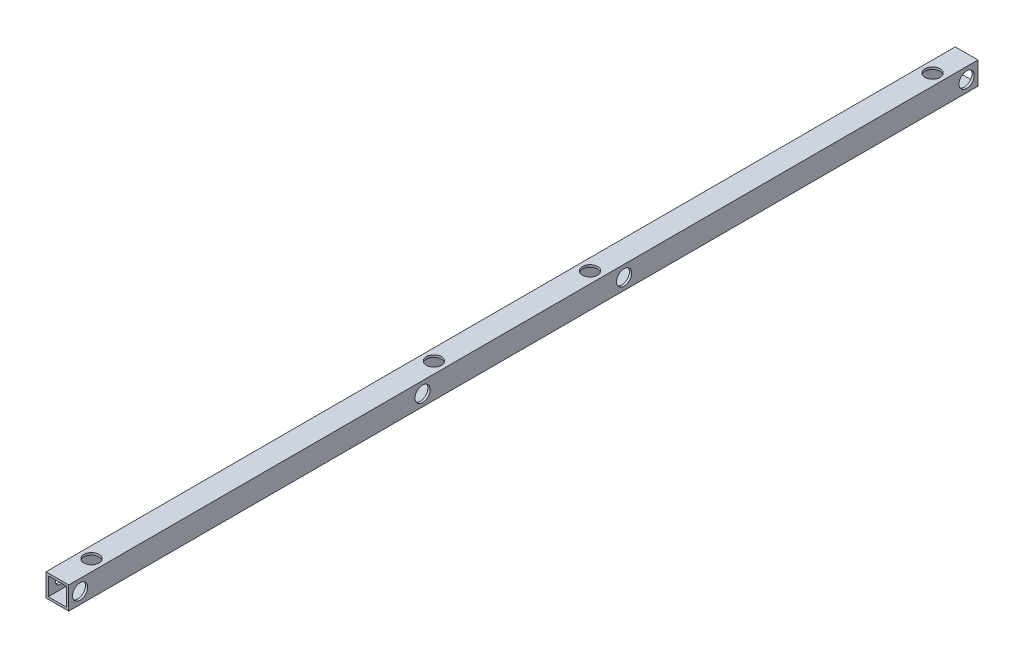
ISO-10303-21;
HEADER;
FILE_DESCRIPTION(('STEP AP214'),'2;1');
FILE_NAME('part.step','',(''),(''),'','','');
FILE_SCHEMA(('AUTOMOTIVE_DESIGN { 1 0 10303 214 1 1 1 1 }'));
ENDSEC;
DATA;
#1=APPLICATION_CONTEXT('core data for automotive mechanical design processes');
#2=APPLICATION_PROTOCOL_DEFINITION('international standard','automotive_design',2000,#1);
#3=PRODUCT_CONTEXT('',#1,'mechanical');
#4=PRODUCT('Part','Part','',(#3));
#5=PRODUCT_RELATED_PRODUCT_CATEGORY('part','',(#4));
#6=PRODUCT_DEFINITION_FORMATION('','',#4);
#7=PRODUCT_DEFINITION_CONTEXT('part definition',#1,'design');
#8=PRODUCT_DEFINITION('design','',#6,#7);
#9=PRODUCT_DEFINITION_SHAPE('','',#8);
#10=(LENGTH_UNIT() NAMED_UNIT(*) SI_UNIT(.MILLI.,.METRE.));
#11=(NAMED_UNIT(*) PLANE_ANGLE_UNIT() SI_UNIT($,.RADIAN.));
#12=(NAMED_UNIT(*) SI_UNIT($,.STERADIAN.) SOLID_ANGLE_UNIT());
#13=UNCERTAINTY_MEASURE_WITH_UNIT(LENGTH_MEASURE(1.E-05),#10,'distance_accuracy_value','');
#14=(GEOMETRIC_REPRESENTATION_CONTEXT(3) GLOBAL_UNCERTAINTY_ASSIGNED_CONTEXT((#13)) GLOBAL_UNIT_ASSIGNED_CONTEXT((#10,
#11,#12)) REPRESENTATION_CONTEXT('',''));
#15=CARTESIAN_POINT('',(0.,0.,0.));
#16=DIRECTION('',(0.,0.,1.));
#17=DIRECTION('',(1.,0.,0.));
#18=AXIS2_PLACEMENT_3D('',#15,#16,#17);
#19=CARTESIAN_POINT('',(0.,0.,600.));
#20=DIRECTION('',(0.,0.,-1.));
#21=DIRECTION('',(-1.,0.,0.));
#22=AXIS2_PLACEMENT_3D('',#19,#20,#21);
#23=PLANE('',#22);
#24=DIRECTION('',(0.,1.,0.));
#25=VECTOR('',#24,1.);
#26=CARTESIAN_POINT('',(7.5,-7.5,600.));
#27=LINE('',#26,#25);
#28=CARTESIAN_POINT('',(7.5,-7.5,600.));
#29=VERTEX_POINT('',#28);
#30=CARTESIAN_POINT('',(7.5,7.5,600.));
#31=VERTEX_POINT('',#30);
#32=EDGE_CURVE('E162',#29,#31,#27,.T.);
#33=ORIENTED_EDGE('',*,*,#32,.T.);
#34=DIRECTION('',(-1.,0.,0.));
#35=VECTOR('',#34,1.);
#36=CARTESIAN_POINT('',(-7.5,7.5,600.));
#37=LINE('',#36,#35);
#38=CARTESIAN_POINT('',(-7.5,7.5,600.));
#39=VERTEX_POINT('',#38);
#40=EDGE_CURVE('E166',#31,#39,#37,.T.);
#41=ORIENTED_EDGE('',*,*,#40,.T.);
#42=DIRECTION('',(0.,-1.,0.));
#43=VECTOR('',#42,1.);
#44=CARTESIAN_POINT('',(-7.5,-7.5,600.));
#45=LINE('',#44,#43);
#46=CARTESIAN_POINT('',(-7.5,-7.5,600.));
#47=VERTEX_POINT('',#46);
#48=EDGE_CURVE('E170',#39,#47,#45,.T.);
#49=ORIENTED_EDGE('',*,*,#48,.T.);
#50=DIRECTION('',(1.,0.,0.));
#51=VECTOR('',#50,1.);
#52=CARTESIAN_POINT('',(-7.5,-7.5,600.));
#53=LINE('',#52,#51);
#54=EDGE_CURVE('E173',#47,#29,#53,.T.);
#55=ORIENTED_EDGE('',*,*,#54,.T.);
#56=EDGE_LOOP('',(#33,#41,#49,#55));
#57=FACE_BOUND('',#56,.T.);
#58=DIRECTION('',(0.,1.,0.));
#59=VECTOR('',#58,1.);
#60=CARTESIAN_POINT('',(6.,-6.,600.));
#61=LINE('',#60,#59);
#62=CARTESIAN_POINT('',(6.,-6.,600.));
#63=VERTEX_POINT('',#62);
#64=CARTESIAN_POINT('',(6.,6.,600.));
#65=VERTEX_POINT('',#64);
#66=EDGE_CURVE('E111',#63,#65,#61,.T.);
#67=ORIENTED_EDGE('',*,*,#66,.F.);
#68=DIRECTION('',(1.,0.,0.));
#69=VECTOR('',#68,1.);
#70=CARTESIAN_POINT('',(-6.,-6.,600.));
#71=LINE('',#70,#69);
#72=CARTESIAN_POINT('',(-6.,-6.,600.));
#73=VERTEX_POINT('',#72);
#74=EDGE_CURVE('E138',#73,#63,#71,.T.);
#75=ORIENTED_EDGE('',*,*,#74,.F.);
#76=DIRECTION('',(0.,-1.,0.));
#77=VECTOR('',#76,1.);
#78=CARTESIAN_POINT('',(-6.,-6.,600.));
#79=LINE('',#78,#77);
#80=CARTESIAN_POINT('',(-6.,6.,600.));
#81=VERTEX_POINT('',#80);
#82=EDGE_CURVE('E133',#81,#73,#79,.T.);
#83=ORIENTED_EDGE('',*,*,#82,.F.);
#84=DIRECTION('',(-1.,0.,0.));
#85=VECTOR('',#84,1.);
#86=CARTESIAN_POINT('',(-6.,6.,600.));
#87=LINE('',#86,#85);
#88=EDGE_CURVE('E120',#65,#81,#87,.T.);
#89=ORIENTED_EDGE('',*,*,#88,.F.);
#90=EDGE_LOOP('',(#67,#75,#83,#89));
#91=FACE_BOUND('',#90,.T.);
#92=ADVANCED_FACE('F43',(#57,#91),#23,.F.);
#93=CARTESIAN_POINT('',(0.,0.,0.));
#94=DIRECTION('',(0.,0.,-1.));
#95=DIRECTION('',(-1.,0.,0.));
#96=AXIS2_PLACEMENT_3D('',#93,#94,#95);
#97=PLANE('',#96);
#98=DIRECTION('',(0.,1.,0.));
#99=VECTOR('',#98,1.);
#100=CARTESIAN_POINT('',(7.5,-7.5,0.));
#101=LINE('',#100,#99);
#102=CARTESIAN_POINT('',(7.5,-7.5,0.));
#103=VERTEX_POINT('',#102);
#104=CARTESIAN_POINT('',(7.5,7.5,0.));
#105=VERTEX_POINT('',#104);
#106=EDGE_CURVE('E129',#103,#105,#101,.T.);
#107=ORIENTED_EDGE('',*,*,#106,.F.);
#108=DIRECTION('',(1.,0.,0.));
#109=VECTOR('',#108,1.);
#110=CARTESIAN_POINT('',(-7.5,-7.5,0.));
#111=LINE('',#110,#109);
#112=CARTESIAN_POINT('',(-7.5,-7.5,0.));
#113=VERTEX_POINT('',#112);
#114=EDGE_CURVE('E167',#113,#103,#111,.T.);
#115=ORIENTED_EDGE('',*,*,#114,.F.);
#116=DIRECTION('',(0.,-1.,0.));
#117=VECTOR('',#116,1.);
#118=CARTESIAN_POINT('',(-7.5,-7.5,0.));
#119=LINE('',#118,#117);
#120=CARTESIAN_POINT('',(-7.5,7.5,0.));
#121=VERTEX_POINT('',#120);
#122=EDGE_CURVE('E183',#121,#113,#119,.T.);
#123=ORIENTED_EDGE('',*,*,#122,.F.);
#124=DIRECTION('',(-1.,0.,0.));
#125=VECTOR('',#124,1.);
#126=CARTESIAN_POINT('',(-7.5,7.5,0.));
#127=LINE('',#126,#125);
#128=EDGE_CURVE('E180',#105,#121,#127,.T.);
#129=ORIENTED_EDGE('',*,*,#128,.F.);
#130=EDGE_LOOP('',(#107,#115,#123,#129));
#131=FACE_BOUND('',#130,.T.);
#132=DIRECTION('',(1.,0.,0.));
#133=VECTOR('',#132,1.);
#134=CARTESIAN_POINT('',(-6.,-6.,0.));
#135=LINE('',#134,#133);
#136=CARTESIAN_POINT('',(-6.,-6.,0.));
#137=VERTEX_POINT('',#136);
#138=CARTESIAN_POINT('',(6.,-6.,0.));
#139=VERTEX_POINT('',#138);
#140=EDGE_CURVE('E121',#137,#139,#135,.T.);
#141=ORIENTED_EDGE('',*,*,#140,.T.);
#142=DIRECTION('',(0.,1.,0.));
#143=VECTOR('',#142,1.);
#144=CARTESIAN_POINT('',(6.,-6.,0.));
#145=LINE('',#144,#143);
#146=CARTESIAN_POINT('',(6.,6.,0.));
#147=VERTEX_POINT('',#146);
#148=EDGE_CURVE('E69',#139,#147,#145,.T.);
#149=ORIENTED_EDGE('',*,*,#148,.T.);
#150=DIRECTION('',(-1.,0.,0.));
#151=VECTOR('',#150,1.);
#152=CARTESIAN_POINT('',(-6.,6.,0.));
#153=LINE('',#152,#151);
#154=CARTESIAN_POINT('',(-6.,6.,0.));
#155=VERTEX_POINT('',#154);
#156=EDGE_CURVE('E127',#147,#155,#153,.T.);
#157=ORIENTED_EDGE('',*,*,#156,.T.);
#158=DIRECTION('',(0.,-1.,0.));
#159=VECTOR('',#158,1.);
#160=CARTESIAN_POINT('',(-6.,-6.,0.));
#161=LINE('',#160,#159);
#162=EDGE_CURVE('E149',#155,#137,#161,.T.);
#163=ORIENTED_EDGE('',*,*,#162,.T.);
#164=EDGE_LOOP('',(#141,#149,#157,#163));
#165=FACE_BOUND('',#164,.T.);
#166=ADVANCED_FACE('F333',(#131,#165),#97,.T.);
#167=CARTESIAN_POINT('',(7.5,-7.5,600.));
#168=DIRECTION('',(-1.,0.,0.));
#169=DIRECTION('',(0.,0.,1.));
#170=AXIS2_PLACEMENT_3D('',#167,#168,#169);
#171=PLANE('',#170);
#172=CARTESIAN_POINT('',(7.5,0.,592.5));
#173=DIRECTION('',(1.,0.,0.));
#174=DIRECTION('',(0.,0.,-1.));
#175=AXIS2_PLACEMENT_3D('',#172,#173,#174);
#176=CIRCLE('',#175,5.00000000000004);
#177=CARTESIAN_POINT('',(7.5,0.,587.5));
#178=VERTEX_POINT('',#177);
#179=EDGE_CURVE('E259',#178,#178,#176,.T.);
#180=ORIENTED_EDGE('',*,*,#179,.F.);
#181=EDGE_LOOP('',(#180));
#182=FACE_BOUND('',#181,.T.);
#183=CARTESIAN_POINT('',(7.5,0.,366.5));
#184=DIRECTION('',(1.,0.,0.));
#185=DIRECTION('',(0.,0.,-1.));
#186=AXIS2_PLACEMENT_3D('',#183,#184,#185);
#187=CIRCLE('',#186,4.99999999999999);
#188=CARTESIAN_POINT('',(7.5,0.,361.5));
#189=VERTEX_POINT('',#188);
#190=EDGE_CURVE('E529',#189,#189,#187,.T.);
#191=ORIENTED_EDGE('',*,*,#190,.F.);
#192=EDGE_LOOP('',(#191));
#193=FACE_BOUND('',#192,.T.);
#194=CARTESIAN_POINT('',(7.5,0.,233.5));
#195=DIRECTION('',(1.,0.,0.));
#196=DIRECTION('',(0.,0.,-1.));
#197=AXIS2_PLACEMENT_3D('',#194,#195,#196);
#198=CIRCLE('',#197,4.99999999999999);
#199=CARTESIAN_POINT('',(7.5,0.,228.5));
#200=VERTEX_POINT('',#199);
#201=EDGE_CURVE('E534',#200,#200,#198,.T.);
#202=ORIENTED_EDGE('',*,*,#201,.F.);
#203=EDGE_LOOP('',(#202));
#204=FACE_BOUND('',#203,.T.);
#205=CARTESIAN_POINT('',(7.5,0.,7.5));
#206=DIRECTION('',(1.,0.,0.));
#207=DIRECTION('',(0.,0.,-1.));
#208=AXIS2_PLACEMENT_3D('',#205,#206,#207);
#209=CIRCLE('',#208,5.);
#210=CARTESIAN_POINT('',(7.5,0.,2.5));
#211=VERTEX_POINT('',#210);
#212=EDGE_CURVE('E540',#211,#211,#209,.T.);
#213=ORIENTED_EDGE('',*,*,#212,.F.);
#214=EDGE_LOOP('',(#213));
#215=FACE_BOUND('',#214,.T.);
#216=ORIENTED_EDGE('',*,*,#106,.T.);
#217=DIRECTION('',(0.,0.,-1.));
#218=VECTOR('',#217,1.);
#219=CARTESIAN_POINT('',(7.5,7.5,600.));
#220=LINE('',#219,#218);
#221=EDGE_CURVE('E11',#31,#105,#220,.T.);
#222=ORIENTED_EDGE('',*,*,#221,.F.);
#223=ORIENTED_EDGE('',*,*,#32,.F.);
#224=DIRECTION('',(0.,0.,-1.));
#225=VECTOR('',#224,1.);
#226=CARTESIAN_POINT('',(7.5,-7.5,600.));
#227=LINE('',#226,#225);
#228=EDGE_CURVE('E176',#29,#103,#227,.T.);
#229=ORIENTED_EDGE('',*,*,#228,.T.);
#230=EDGE_LOOP('',(#216,#222,#223,#229));
#231=FACE_BOUND('',#230,.T.);
#232=ADVANCED_FACE('F45',(#182,#193,#204,#215,#231),#171,.F.);
#233=CARTESIAN_POINT('',(-7.5,7.5,600.));
#234=DIRECTION('',(0.,-1.,0.));
#235=DIRECTION('',(0.,0.,-1.));
#236=AXIS2_PLACEMENT_3D('',#233,#234,#235);
#237=PLANE('',#236);
#238=CARTESIAN_POINT('',(0.,7.5,577.5));
#239=DIRECTION('',(0.,1.,0.));
#240=DIRECTION('',(0.,0.,1.));
#241=AXIS2_PLACEMENT_3D('',#238,#239,#240);
#242=CIRCLE('',#241,5.);
#243=CARTESIAN_POINT('',(0.,7.5,582.5));
#244=VERTEX_POINT('',#243);
#245=EDGE_CURVE('E243',#244,#244,#242,.T.);
#246=ORIENTED_EDGE('',*,*,#245,.F.);
#247=EDGE_LOOP('',(#246));
#248=FACE_BOUND('',#247,.T.);
#249=CARTESIAN_POINT('',(1.20131184839878E-12,7.5,351.5));
#250=DIRECTION('',(0.,1.,0.));
#251=DIRECTION('',(0.,0.,1.));
#252=AXIS2_PLACEMENT_3D('',#249,#250,#251);
#253=CIRCLE('',#252,5.);
#254=CARTESIAN_POINT('',(1.20131184839878E-12,7.5,356.5));
#255=VERTEX_POINT('',#254);
#256=EDGE_CURVE('E283',#255,#255,#253,.T.);
#257=ORIENTED_EDGE('',*,*,#256,.F.);
#258=EDGE_LOOP('',(#257));
#259=FACE_BOUND('',#258,.T.);
#260=CARTESIAN_POINT('',(1.23350956270674E-12,7.5,248.5));
#261=DIRECTION('',(0.,1.,0.));
#262=DIRECTION('',(0.,0.,1.));
#263=AXIS2_PLACEMENT_3D('',#260,#261,#262);
#264=CIRCLE('',#263,5.);
#265=CARTESIAN_POINT('',(1.23350956270674E-12,7.5,253.5));
#266=VERTEX_POINT('',#265);
#267=EDGE_CURVE('E276',#266,#266,#264,.T.);
#268=ORIENTED_EDGE('',*,*,#267,.F.);
#269=EDGE_LOOP('',(#268));
#270=FACE_BOUND('',#269,.T.);
#271=CARTESIAN_POINT('',(2.67069220397528E-12,7.5,22.5));
#272=DIRECTION('',(0.,1.,0.));
#273=DIRECTION('',(0.,0.,1.));
#274=AXIS2_PLACEMENT_3D('',#271,#272,#273);
#275=CIRCLE('',#274,5.00000000000316);
#276=CARTESIAN_POINT('',(2.67069220397528E-12,7.5,27.5000000000031));
#277=VERTEX_POINT('',#276);
#278=EDGE_CURVE('E270',#277,#277,#275,.T.);
#279=ORIENTED_EDGE('',*,*,#278,.F.);
#280=EDGE_LOOP('',(#279));
#281=FACE_BOUND('',#280,.T.);
#282=ORIENTED_EDGE('',*,*,#128,.T.);
#283=DIRECTION('',(0.,0.,-1.));
#284=VECTOR('',#283,1.);
#285=CARTESIAN_POINT('',(-7.5,7.5,600.));
#286=LINE('',#285,#284);
#287=EDGE_CURVE('E53',#39,#121,#286,.T.);
#288=ORIENTED_EDGE('',*,*,#287,.F.);
#289=ORIENTED_EDGE('',*,*,#40,.F.);
#290=ORIENTED_EDGE('',*,*,#221,.T.);
#291=EDGE_LOOP('',(#282,#288,#289,#290));
#292=FACE_BOUND('',#291,.T.);
#293=ADVANCED_FACE('F348',(#248,#259,#270,#281,#292),#237,.F.);
#294=CARTESIAN_POINT('',(-7.5,-7.5,600.));
#295=DIRECTION('',(1.,0.,0.));
#296=DIRECTION('',(0.,0.,-1.));
#297=AXIS2_PLACEMENT_3D('',#294,#295,#296);
#298=PLANE('',#297);
#299=CARTESIAN_POINT('',(-7.5,0.,592.5));
#300=DIRECTION('',(1.,0.,0.));
#301=DIRECTION('',(0.,0.,-1.));
#302=AXIS2_PLACEMENT_3D('',#299,#300,#301);
#303=CIRCLE('',#302,2.70000000000001);
#304=CARTESIAN_POINT('',(-7.5,0.,589.8));
#305=VERTEX_POINT('',#304);
#306=EDGE_CURVE('E146',#305,#305,#303,.T.);
#307=ORIENTED_EDGE('',*,*,#306,.T.);
#308=EDGE_LOOP('',(#307));
#309=FACE_BOUND('',#308,.T.);
#310=CARTESIAN_POINT('',(-7.5,0.,233.5));
#311=DIRECTION('',(1.,0.,0.));
#312=DIRECTION('',(0.,0.,-1.));
#313=AXIS2_PLACEMENT_3D('',#310,#311,#312);
#314=CIRCLE('',#313,2.70000000000001);
#315=CARTESIAN_POINT('',(-7.5,0.,230.8));
#316=VERTEX_POINT('',#315);
#317=EDGE_CURVE('E213',#316,#316,#314,.T.);
#318=ORIENTED_EDGE('',*,*,#317,.T.);
#319=EDGE_LOOP('',(#318));
#320=FACE_BOUND('',#319,.T.);
#321=CARTESIAN_POINT('',(-7.5,0.,7.5));
#322=DIRECTION('',(1.,0.,0.));
#323=DIRECTION('',(0.,0.,-1.));
#324=AXIS2_PLACEMENT_3D('',#321,#322,#323);
#325=CIRCLE('',#324,2.7);
#326=CARTESIAN_POINT('',(-7.5,0.,4.8));
#327=VERTEX_POINT('',#326);
#328=EDGE_CURVE('E208',#327,#327,#325,.T.);
#329=ORIENTED_EDGE('',*,*,#328,.T.);
#330=EDGE_LOOP('',(#329));
#331=FACE_BOUND('',#330,.T.);
#332=CARTESIAN_POINT('',(-7.5,0.,366.5));
#333=DIRECTION('',(1.,0.,0.));
#334=DIRECTION('',(0.,0.,-1.));
#335=AXIS2_PLACEMENT_3D('',#332,#333,#334);
#336=CIRCLE('',#335,2.69999999999996);
#337=CARTESIAN_POINT('',(-7.5,0.,363.8));
#338=VERTEX_POINT('',#337);
#339=EDGE_CURVE('E202',#338,#338,#336,.T.);
#340=ORIENTED_EDGE('',*,*,#339,.T.);
#341=EDGE_LOOP('',(#340));
#342=FACE_BOUND('',#341,.T.);
#343=ORIENTED_EDGE('',*,*,#122,.T.);
#344=DIRECTION('',(0.,0.,-1.));
#345=VECTOR('',#344,1.);
#346=CARTESIAN_POINT('',(-7.5,-7.5,600.));
#347=LINE('',#346,#345);
#348=EDGE_CURVE('E191',#47,#113,#347,.T.);
#349=ORIENTED_EDGE('',*,*,#348,.F.);
#350=ORIENTED_EDGE('',*,*,#48,.F.);
#351=ORIENTED_EDGE('',*,*,#287,.T.);
#352=EDGE_LOOP('',(#343,#349,#350,#351));
#353=FACE_BOUND('',#352,.T.);
#354=ADVANCED_FACE('F312',(#309,#320,#331,#342,#353),#298,.F.);
#355=CARTESIAN_POINT('',(-7.5,-7.5,600.));
#356=DIRECTION('',(0.,1.,0.));
#357=DIRECTION('',(0.,0.,1.));
#358=AXIS2_PLACEMENT_3D('',#355,#356,#357);
#359=PLANE('',#358);
#360=CARTESIAN_POINT('',(4.57423704001417E-12,-7.5,577.5));
#361=DIRECTION('',(0.,1.,0.));
#362=DIRECTION('',(0.,0.,1.));
#363=AXIS2_PLACEMENT_3D('',#360,#361,#362);
#364=CIRCLE('',#363,2.24999999999924);
#365=CARTESIAN_POINT('',(4.57423704001417E-12,-7.5,579.749999999999));
#366=VERTEX_POINT('',#365);
#367=EDGE_CURVE('E203',#366,#366,#364,.T.);
#368=ORIENTED_EDGE('',*,*,#367,.T.);
#369=EDGE_LOOP('',(#368));
#370=FACE_BOUND('',#369,.T.);
#371=CARTESIAN_POINT('',(2.67069220397528E-12,-7.5,22.5));
#372=DIRECTION('',(0.,1.,0.));
#373=DIRECTION('',(0.,0.,1.));
#374=AXIS2_PLACEMENT_3D('',#371,#372,#373);
#375=CIRCLE('',#374,2.24999999999777);
#376=CARTESIAN_POINT('',(2.67069220397528E-12,-7.5,24.7499999999978));
#377=VERTEX_POINT('',#376);
#378=EDGE_CURVE('E233',#377,#377,#375,.T.);
#379=ORIENTED_EDGE('',*,*,#378,.T.);
#380=EDGE_LOOP('',(#379));
#381=FACE_BOUND('',#380,.T.);
#382=CARTESIAN_POINT('',(1.23350956270674E-12,-7.5,248.5));
#383=DIRECTION('',(0.,1.,0.));
#384=DIRECTION('',(0.,0.,1.));
#385=AXIS2_PLACEMENT_3D('',#382,#383,#384);
#386=CIRCLE('',#385,2.25);
#387=CARTESIAN_POINT('',(1.23350956270674E-12,-7.5,250.75));
#388=VERTEX_POINT('',#387);
#389=EDGE_CURVE('E228',#388,#388,#386,.T.);
#390=ORIENTED_EDGE('',*,*,#389,.T.);
#391=EDGE_LOOP('',(#390));
#392=FACE_BOUND('',#391,.T.);
#393=CARTESIAN_POINT('',(1.20131184839878E-12,-7.5,351.5));
#394=DIRECTION('',(0.,1.,0.));
#395=DIRECTION('',(0.,0.,1.));
#396=AXIS2_PLACEMENT_3D('',#393,#394,#395);
#397=CIRCLE('',#396,2.25);
#398=CARTESIAN_POINT('',(1.20131184839878E-12,-7.5,353.75));
#399=VERTEX_POINT('',#398);
#400=EDGE_CURVE('E222',#399,#399,#397,.T.);
#401=ORIENTED_EDGE('',*,*,#400,.T.);
#402=EDGE_LOOP('',(#401));
#403=FACE_BOUND('',#402,.T.);
#404=ORIENTED_EDGE('',*,*,#114,.T.);
#405=ORIENTED_EDGE('',*,*,#228,.F.);
#406=ORIENTED_EDGE('',*,*,#54,.F.);
#407=ORIENTED_EDGE('',*,*,#348,.T.);
#408=EDGE_LOOP('',(#404,#405,#406,#407));
#409=FACE_BOUND('',#408,.T.);
#410=ADVANCED_FACE('F344',(#370,#381,#392,#403,#409),#359,.F.);
#411=CARTESIAN_POINT('',(6.,-6.,600.));
#412=DIRECTION('',(-1.,0.,0.));
#413=DIRECTION('',(0.,0.,1.));
#414=AXIS2_PLACEMENT_3D('',#411,#412,#413);
#415=PLANE('',#414);
#416=CARTESIAN_POINT('',(6.,0.,592.5));
#417=DIRECTION('',(-1.,0.,0.));
#418=DIRECTION('',(0.,0.,1.));
#419=AXIS2_PLACEMENT_3D('',#416,#417,#418);
#420=CIRCLE('',#419,5.00000000000004);
#421=CARTESIAN_POINT('',(6.,0.,597.5));
#422=VERTEX_POINT('',#421);
#423=EDGE_CURVE('E47',#422,#422,#420,.T.);
#424=ORIENTED_EDGE('',*,*,#423,.F.);
#425=EDGE_LOOP('',(#424));
#426=FACE_BOUND('',#425,.T.);
#427=CARTESIAN_POINT('',(6.,0.,366.5));
#428=DIRECTION('',(-1.,0.,0.));
#429=DIRECTION('',(0.,0.,1.));
#430=AXIS2_PLACEMENT_3D('',#427,#428,#429);
#431=CIRCLE('',#430,4.99999999999999);
#432=CARTESIAN_POINT('',(6.,0.,371.5));
#433=VERTEX_POINT('',#432);
#434=EDGE_CURVE('E262',#433,#433,#431,.T.);
#435=ORIENTED_EDGE('',*,*,#434,.F.);
#436=EDGE_LOOP('',(#435));
#437=FACE_BOUND('',#436,.T.);
#438=CARTESIAN_POINT('',(6.,0.,233.5));
#439=DIRECTION('',(-1.,0.,0.));
#440=DIRECTION('',(0.,0.,1.));
#441=AXIS2_PLACEMENT_3D('',#438,#439,#440);
#442=CIRCLE('',#441,4.99999999999999);
#443=CARTESIAN_POINT('',(6.,0.,238.5));
#444=VERTEX_POINT('',#443);
#445=EDGE_CURVE('E258',#444,#444,#442,.T.);
#446=ORIENTED_EDGE('',*,*,#445,.F.);
#447=EDGE_LOOP('',(#446));
#448=FACE_BOUND('',#447,.T.);
#449=CARTESIAN_POINT('',(6.,0.,7.5));
#450=DIRECTION('',(-1.,0.,0.));
#451=DIRECTION('',(0.,0.,1.));
#452=AXIS2_PLACEMENT_3D('',#449,#450,#451);
#453=CIRCLE('',#452,5.);
#454=CARTESIAN_POINT('',(6.,0.,12.5));
#455=VERTEX_POINT('',#454);
#456=EDGE_CURVE('E254',#455,#455,#453,.T.);
#457=ORIENTED_EDGE('',*,*,#456,.F.);
#458=EDGE_LOOP('',(#457));
#459=FACE_BOUND('',#458,.T.);
#460=ORIENTED_EDGE('',*,*,#148,.F.);
#461=DIRECTION('',(0.,0.,-1.));
#462=VECTOR('',#461,1.);
#463=CARTESIAN_POINT('',(6.,-6.,600.));
#464=LINE('',#463,#462);
#465=EDGE_CURVE('E115',#63,#139,#464,.T.);
#466=ORIENTED_EDGE('',*,*,#465,.F.);
#467=ORIENTED_EDGE('',*,*,#66,.T.);
#468=DIRECTION('',(0.,0.,-1.));
#469=VECTOR('',#468,1.);
#470=CARTESIAN_POINT('',(6.,6.,600.));
#471=LINE('',#470,#469);
#472=EDGE_CURVE('E114',#65,#147,#471,.T.);
#473=ORIENTED_EDGE('',*,*,#472,.T.);
#474=EDGE_LOOP('',(#460,#466,#467,#473));
#475=FACE_BOUND('',#474,.T.);
#476=ADVANCED_FACE('F113',(#426,#437,#448,#459,#475),#415,.T.);
#477=CARTESIAN_POINT('',(-6.,6.,600.));
#478=DIRECTION('',(0.,-1.,0.));
#479=DIRECTION('',(0.,0.,-1.));
#480=AXIS2_PLACEMENT_3D('',#477,#478,#479);
#481=PLANE('',#480);
#482=CARTESIAN_POINT('',(0.,6.,577.5));
#483=DIRECTION('',(0.,-1.,0.));
#484=DIRECTION('',(0.,0.,-1.));
#485=AXIS2_PLACEMENT_3D('',#482,#483,#484);
#486=CIRCLE('',#485,5.);
#487=CARTESIAN_POINT('',(0.,6.,572.5));
#488=VERTEX_POINT('',#487);
#489=EDGE_CURVE('E223',#488,#488,#486,.T.);
#490=ORIENTED_EDGE('',*,*,#489,.F.);
#491=EDGE_LOOP('',(#490));
#492=FACE_BOUND('',#491,.T.);
#493=CARTESIAN_POINT('',(1.20131184839878E-12,6.,351.5));
#494=DIRECTION('',(0.,-1.,0.));
#495=DIRECTION('',(0.,0.,-1.));
#496=AXIS2_PLACEMENT_3D('',#493,#494,#495);
#497=CIRCLE('',#496,5.);
#498=CARTESIAN_POINT('',(1.20131184839878E-12,6.,346.5));
#499=VERTEX_POINT('',#498);
#500=EDGE_CURVE('E247',#499,#499,#497,.T.);
#501=ORIENTED_EDGE('',*,*,#500,.F.);
#502=EDGE_LOOP('',(#501));
#503=FACE_BOUND('',#502,.T.);
#504=CARTESIAN_POINT('',(1.23350956270674E-12,6.,248.5));
#505=DIRECTION('',(0.,-1.,0.));
#506=DIRECTION('',(0.,0.,-1.));
#507=AXIS2_PLACEMENT_3D('',#504,#505,#506);
#508=CIRCLE('',#507,5.);
#509=CARTESIAN_POINT('',(1.23350956270674E-12,6.,243.5));
#510=VERTEX_POINT('',#509);
#511=EDGE_CURVE('E242',#510,#510,#508,.T.);
#512=ORIENTED_EDGE('',*,*,#511,.F.);
#513=EDGE_LOOP('',(#512));
#514=FACE_BOUND('',#513,.T.);
#515=CARTESIAN_POINT('',(2.67069220397528E-12,6.,22.5));
#516=DIRECTION('',(0.,-1.,0.));
#517=DIRECTION('',(0.,0.,-1.));
#518=AXIS2_PLACEMENT_3D('',#515,#516,#517);
#519=CIRCLE('',#518,5.00000000000316);
#520=CARTESIAN_POINT('',(2.67069220397528E-12,6.,17.4999999999968));
#521=VERTEX_POINT('',#520);
#522=EDGE_CURVE('E238',#521,#521,#519,.T.);
#523=ORIENTED_EDGE('',*,*,#522,.F.);
#524=EDGE_LOOP('',(#523));
#525=FACE_BOUND('',#524,.T.);
#526=ORIENTED_EDGE('',*,*,#156,.F.);
#527=ORIENTED_EDGE('',*,*,#472,.F.);
#528=ORIENTED_EDGE('',*,*,#88,.T.);
#529=DIRECTION('',(0.,0.,-1.));
#530=VECTOR('',#529,1.);
#531=CARTESIAN_POINT('',(-6.,6.,600.));
#532=LINE('',#531,#530);
#533=EDGE_CURVE('E130',#81,#155,#532,.T.);
#534=ORIENTED_EDGE('',*,*,#533,.T.);
#535=EDGE_LOOP('',(#526,#527,#528,#534));
#536=FACE_BOUND('',#535,.T.);
#537=ADVANCED_FACE('F124',(#492,#503,#514,#525,#536),#481,.T.);
#538=CARTESIAN_POINT('',(-6.,-6.,600.));
#539=DIRECTION('',(1.,0.,0.));
#540=DIRECTION('',(0.,0.,-1.));
#541=AXIS2_PLACEMENT_3D('',#538,#539,#540);
#542=PLANE('',#541);
#543=CARTESIAN_POINT('',(-6.,0.,592.5));
#544=DIRECTION('',(1.,0.,0.));
#545=DIRECTION('',(0.,0.,-1.));
#546=AXIS2_PLACEMENT_3D('',#543,#544,#545);
#547=CIRCLE('',#546,2.70000000000001);
#548=CARTESIAN_POINT('',(-6.,0.,589.8));
#549=VERTEX_POINT('',#548);
#550=EDGE_CURVE('E214',#549,#549,#547,.T.);
#551=ORIENTED_EDGE('',*,*,#550,.F.);
#552=EDGE_LOOP('',(#551));
#553=FACE_BOUND('',#552,.T.);
#554=CARTESIAN_POINT('',(-6.,0.,233.5));
#555=DIRECTION('',(1.,0.,0.));
#556=DIRECTION('',(0.,0.,-1.));
#557=AXIS2_PLACEMENT_3D('',#554,#555,#556);
#558=CIRCLE('',#557,2.70000000000001);
#559=CARTESIAN_POINT('',(-6.,0.,230.8));
#560=VERTEX_POINT('',#559);
#561=EDGE_CURVE('E209',#560,#560,#558,.T.);
#562=ORIENTED_EDGE('',*,*,#561,.F.);
#563=EDGE_LOOP('',(#562));
#564=FACE_BOUND('',#563,.T.);
#565=CARTESIAN_POINT('',(-6.,0.,7.5));
#566=DIRECTION('',(1.,0.,0.));
#567=DIRECTION('',(0.,0.,-1.));
#568=AXIS2_PLACEMENT_3D('',#565,#566,#567);
#569=CIRCLE('',#568,2.7);
#570=CARTESIAN_POINT('',(-6.,0.,4.8));
#571=VERTEX_POINT('',#570);
#572=EDGE_CURVE('E204',#571,#571,#569,.T.);
#573=ORIENTED_EDGE('',*,*,#572,.F.);
#574=EDGE_LOOP('',(#573));
#575=FACE_BOUND('',#574,.T.);
#576=CARTESIAN_POINT('',(-6.,0.,366.5));
#577=DIRECTION('',(1.,0.,0.));
#578=DIRECTION('',(0.,0.,-1.));
#579=AXIS2_PLACEMENT_3D('',#576,#577,#578);
#580=CIRCLE('',#579,2.69999999999996);
#581=CARTESIAN_POINT('',(-6.,0.,363.8));
#582=VERTEX_POINT('',#581);
#583=EDGE_CURVE('E198',#582,#582,#580,.T.);
#584=ORIENTED_EDGE('',*,*,#583,.F.);
#585=EDGE_LOOP('',(#584));
#586=FACE_BOUND('',#585,.T.);
#587=ORIENTED_EDGE('',*,*,#162,.F.);
#588=ORIENTED_EDGE('',*,*,#533,.F.);
#589=ORIENTED_EDGE('',*,*,#82,.T.);
#590=DIRECTION('',(0.,0.,-1.));
#591=VECTOR('',#590,1.);
#592=CARTESIAN_POINT('',(-6.,-6.,600.));
#593=LINE('',#592,#591);
#594=EDGE_CURVE('E61',#73,#137,#593,.T.);
#595=ORIENTED_EDGE('',*,*,#594,.T.);
#596=EDGE_LOOP('',(#587,#588,#589,#595));
#597=FACE_BOUND('',#596,.T.);
#598=ADVANCED_FACE('F384',(#553,#564,#575,#586,#597),#542,.T.);
#599=CARTESIAN_POINT('',(-6.,-6.,600.));
#600=DIRECTION('',(0.,1.,0.));
#601=DIRECTION('',(0.,0.,1.));
#602=AXIS2_PLACEMENT_3D('',#599,#600,#601);
#603=PLANE('',#602);
#604=CARTESIAN_POINT('',(4.57423704001417E-12,-6.,577.5));
#605=DIRECTION('',(0.,1.,0.));
#606=DIRECTION('',(0.,0.,1.));
#607=AXIS2_PLACEMENT_3D('',#604,#605,#606);
#608=CIRCLE('',#607,2.24999999999924);
#609=CARTESIAN_POINT('',(4.57423704001417E-12,-6.,579.749999999999));
#610=VERTEX_POINT('',#609);
#611=EDGE_CURVE('E234',#610,#610,#608,.T.);
#612=ORIENTED_EDGE('',*,*,#611,.F.);
#613=EDGE_LOOP('',(#612));
#614=FACE_BOUND('',#613,.T.);
#615=CARTESIAN_POINT('',(2.67069220397528E-12,-6.,22.5));
#616=DIRECTION('',(0.,1.,0.));
#617=DIRECTION('',(0.,0.,1.));
#618=AXIS2_PLACEMENT_3D('',#615,#616,#617);
#619=CIRCLE('',#618,2.24999999999777);
#620=CARTESIAN_POINT('',(2.67069220397528E-12,-6.,24.7499999999978));
#621=VERTEX_POINT('',#620);
#622=EDGE_CURVE('E229',#621,#621,#619,.T.);
#623=ORIENTED_EDGE('',*,*,#622,.F.);
#624=EDGE_LOOP('',(#623));
#625=FACE_BOUND('',#624,.T.);
#626=CARTESIAN_POINT('',(1.23350956270674E-12,-6.,248.5));
#627=DIRECTION('',(0.,1.,0.));
#628=DIRECTION('',(0.,0.,1.));
#629=AXIS2_PLACEMENT_3D('',#626,#627,#628);
#630=CIRCLE('',#629,2.25);
#631=CARTESIAN_POINT('',(1.23350956270674E-12,-6.,250.75));
#632=VERTEX_POINT('',#631);
#633=EDGE_CURVE('E224',#632,#632,#630,.T.);
#634=ORIENTED_EDGE('',*,*,#633,.F.);
#635=EDGE_LOOP('',(#634));
#636=FACE_BOUND('',#635,.T.);
#637=CARTESIAN_POINT('',(1.20131184839878E-12,-6.,351.5));
#638=DIRECTION('',(0.,1.,0.));
#639=DIRECTION('',(0.,0.,1.));
#640=AXIS2_PLACEMENT_3D('',#637,#638,#639);
#641=CIRCLE('',#640,2.25);
#642=CARTESIAN_POINT('',(1.20131184839878E-12,-6.,353.75));
#643=VERTEX_POINT('',#642);
#644=EDGE_CURVE('E218',#643,#643,#641,.T.);
#645=ORIENTED_EDGE('',*,*,#644,.F.);
#646=EDGE_LOOP('',(#645));
#647=FACE_BOUND('',#646,.T.);
#648=ORIENTED_EDGE('',*,*,#140,.F.);
#649=ORIENTED_EDGE('',*,*,#594,.F.);
#650=ORIENTED_EDGE('',*,*,#74,.T.);
#651=ORIENTED_EDGE('',*,*,#465,.T.);
#652=EDGE_LOOP('',(#648,#649,#650,#651));
#653=FACE_BOUND('',#652,.T.);
#654=ADVANCED_FACE('F381',(#614,#625,#636,#647,#653),#603,.T.);
#655=CARTESIAN_POINT('',(-17.5,0.,366.5));
#656=DIRECTION('',(1.,0.,0.));
#657=DIRECTION('',(0.,0.,-1.));
#658=AXIS2_PLACEMENT_3D('',#655,#656,#657);
#659=CYLINDRICAL_SURFACE('',#658,2.69999999999996);
#660=ORIENTED_EDGE('',*,*,#583,.T.);
#661=EDGE_LOOP('',(#660));
#662=FACE_BOUND('',#661,.T.);
#663=ORIENTED_EDGE('',*,*,#339,.F.);
#664=EDGE_LOOP('',(#663));
#665=FACE_BOUND('',#664,.T.);
#666=ADVANCED_FACE('F383',(#662,#665),#659,.F.);
#667=CARTESIAN_POINT('',(-17.5,0.,7.5));
#668=DIRECTION('',(1.,0.,0.));
#669=DIRECTION('',(0.,0.,-1.));
#670=AXIS2_PLACEMENT_3D('',#667,#668,#669);
#671=CYLINDRICAL_SURFACE('',#670,2.7);
#672=ORIENTED_EDGE('',*,*,#572,.T.);
#673=EDGE_LOOP('',(#672));
#674=FACE_BOUND('',#673,.T.);
#675=ORIENTED_EDGE('',*,*,#328,.F.);
#676=EDGE_LOOP('',(#675));
#677=FACE_BOUND('',#676,.T.);
#678=ADVANCED_FACE('F329',(#674,#677),#671,.F.);
#679=CARTESIAN_POINT('',(-17.5,0.,233.5));
#680=DIRECTION('',(1.,0.,0.));
#681=DIRECTION('',(0.,0.,-1.));
#682=AXIS2_PLACEMENT_3D('',#679,#680,#681);
#683=CYLINDRICAL_SURFACE('',#682,2.70000000000001);
#684=ORIENTED_EDGE('',*,*,#561,.T.);
#685=EDGE_LOOP('',(#684));
#686=FACE_BOUND('',#685,.T.);
#687=ORIENTED_EDGE('',*,*,#317,.F.);
#688=EDGE_LOOP('',(#687));
#689=FACE_BOUND('',#688,.T.);
#690=ADVANCED_FACE('F318',(#686,#689),#683,.F.);
#691=CARTESIAN_POINT('',(-17.5,0.,592.5));
#692=DIRECTION('',(1.,0.,0.));
#693=DIRECTION('',(0.,0.,-1.));
#694=AXIS2_PLACEMENT_3D('',#691,#692,#693);
#695=CYLINDRICAL_SURFACE('',#694,2.70000000000001);
#696=ORIENTED_EDGE('',*,*,#550,.T.);
#697=EDGE_LOOP('',(#696));
#698=FACE_BOUND('',#697,.T.);
#699=ORIENTED_EDGE('',*,*,#306,.F.);
#700=EDGE_LOOP('',(#699));
#701=FACE_BOUND('',#700,.T.);
#702=ADVANCED_FACE('F315',(#698,#701),#695,.F.);
#703=CARTESIAN_POINT('',(1.20131184839878E-12,-17.5,351.5));
#704=DIRECTION('',(0.,1.,0.));
#705=DIRECTION('',(0.,0.,1.));
#706=AXIS2_PLACEMENT_3D('',#703,#704,#705);
#707=CYLINDRICAL_SURFACE('',#706,2.25);
#708=ORIENTED_EDGE('',*,*,#644,.T.);
#709=EDGE_LOOP('',(#708));
#710=FACE_BOUND('',#709,.T.);
#711=ORIENTED_EDGE('',*,*,#400,.F.);
#712=EDGE_LOOP('',(#711));
#713=FACE_BOUND('',#712,.T.);
#714=ADVANCED_FACE('F317',(#710,#713),#707,.F.);
#715=CARTESIAN_POINT('',(1.23350956270674E-12,-17.5,248.5));
#716=DIRECTION('',(0.,1.,0.));
#717=DIRECTION('',(0.,0.,1.));
#718=AXIS2_PLACEMENT_3D('',#715,#716,#717);
#719=CYLINDRICAL_SURFACE('',#718,2.25);
#720=ORIENTED_EDGE('',*,*,#633,.T.);
#721=EDGE_LOOP('',(#720));
#722=FACE_BOUND('',#721,.T.);
#723=ORIENTED_EDGE('',*,*,#389,.F.);
#724=EDGE_LOOP('',(#723));
#725=FACE_BOUND('',#724,.T.);
#726=ADVANCED_FACE('F326',(#722,#725),#719,.F.);
#727=CARTESIAN_POINT('',(2.67069220397528E-12,-17.5,22.5));
#728=DIRECTION('',(0.,1.,0.));
#729=DIRECTION('',(0.,0.,1.));
#730=AXIS2_PLACEMENT_3D('',#727,#728,#729);
#731=CYLINDRICAL_SURFACE('',#730,2.24999999999777);
#732=ORIENTED_EDGE('',*,*,#622,.T.);
#733=EDGE_LOOP('',(#732));
#734=FACE_BOUND('',#733,.T.);
#735=ORIENTED_EDGE('',*,*,#378,.F.);
#736=EDGE_LOOP('',(#735));
#737=FACE_BOUND('',#736,.T.);
#738=ADVANCED_FACE('F422',(#734,#737),#731,.F.);
#739=CARTESIAN_POINT('',(4.57423704001417E-12,-17.5,577.5));
#740=DIRECTION('',(0.,1.,0.));
#741=DIRECTION('',(0.,0.,1.));
#742=AXIS2_PLACEMENT_3D('',#739,#740,#741);
#743=CYLINDRICAL_SURFACE('',#742,2.24999999999924);
#744=ORIENTED_EDGE('',*,*,#611,.T.);
#745=EDGE_LOOP('',(#744));
#746=FACE_BOUND('',#745,.T.);
#747=ORIENTED_EDGE('',*,*,#367,.F.);
#748=EDGE_LOOP('',(#747));
#749=FACE_BOUND('',#748,.T.);
#750=ADVANCED_FACE('F414',(#746,#749),#743,.F.);
#751=CARTESIAN_POINT('',(2.67069220397528E-12,-2.5,22.5));
#752=DIRECTION('',(0.,1.,0.));
#753=DIRECTION('',(0.,0.,1.));
#754=AXIS2_PLACEMENT_3D('',#751,#752,#753);
#755=CYLINDRICAL_SURFACE('',#754,5.00000000000316);
#756=ORIENTED_EDGE('',*,*,#522,.T.);
#757=EDGE_LOOP('',(#756));
#758=FACE_BOUND('',#757,.T.);
#759=ORIENTED_EDGE('',*,*,#278,.T.);
#760=EDGE_LOOP('',(#759));
#761=FACE_BOUND('',#760,.T.);
#762=ADVANCED_FACE('F412',(#758,#761),#755,.F.);
#763=CARTESIAN_POINT('',(1.23350956270674E-12,-2.5,248.5));
#764=DIRECTION('',(0.,1.,0.));
#765=DIRECTION('',(0.,0.,1.));
#766=AXIS2_PLACEMENT_3D('',#763,#764,#765);
#767=CYLINDRICAL_SURFACE('',#766,5.);
#768=ORIENTED_EDGE('',*,*,#511,.T.);
#769=EDGE_LOOP('',(#768));
#770=FACE_BOUND('',#769,.T.);
#771=ORIENTED_EDGE('',*,*,#267,.T.);
#772=EDGE_LOOP('',(#771));
#773=FACE_BOUND('',#772,.T.);
#774=ADVANCED_FACE('F413',(#770,#773),#767,.F.);
#775=CARTESIAN_POINT('',(1.20131184839878E-12,-2.5,351.5));
#776=DIRECTION('',(0.,1.,0.));
#777=DIRECTION('',(0.,0.,1.));
#778=AXIS2_PLACEMENT_3D('',#775,#776,#777);
#779=CYLINDRICAL_SURFACE('',#778,5.);
#780=ORIENTED_EDGE('',*,*,#500,.T.);
#781=EDGE_LOOP('',(#780));
#782=FACE_BOUND('',#781,.T.);
#783=ORIENTED_EDGE('',*,*,#256,.T.);
#784=EDGE_LOOP('',(#783));
#785=FACE_BOUND('',#784,.T.);
#786=ADVANCED_FACE('F419',(#782,#785),#779,.F.);
#787=CARTESIAN_POINT('',(0.,-2.5,577.5));
#788=DIRECTION('',(0.,1.,0.));
#789=DIRECTION('',(0.,0.,1.));
#790=AXIS2_PLACEMENT_3D('',#787,#788,#789);
#791=CYLINDRICAL_SURFACE('',#790,5.);
#792=ORIENTED_EDGE('',*,*,#489,.T.);
#793=EDGE_LOOP('',(#792));
#794=FACE_BOUND('',#793,.T.);
#795=ORIENTED_EDGE('',*,*,#245,.T.);
#796=EDGE_LOOP('',(#795));
#797=FACE_BOUND('',#796,.T.);
#798=ADVANCED_FACE('F475',(#794,#797),#791,.F.);
#799=CARTESIAN_POINT('',(-2.5,0.,7.5));
#800=DIRECTION('',(1.,0.,0.));
#801=DIRECTION('',(0.,0.,-1.));
#802=AXIS2_PLACEMENT_3D('',#799,#800,#801);
#803=CYLINDRICAL_SURFACE('',#802,5.);
#804=ORIENTED_EDGE('',*,*,#456,.T.);
#805=EDGE_LOOP('',(#804));
#806=FACE_BOUND('',#805,.T.);
#807=ORIENTED_EDGE('',*,*,#212,.T.);
#808=EDGE_LOOP('',(#807));
#809=FACE_BOUND('',#808,.T.);
#810=ADVANCED_FACE('F484',(#806,#809),#803,.F.);
#811=CARTESIAN_POINT('',(-2.5,0.,233.5));
#812=DIRECTION('',(1.,0.,0.));
#813=DIRECTION('',(0.,0.,-1.));
#814=AXIS2_PLACEMENT_3D('',#811,#812,#813);
#815=CYLINDRICAL_SURFACE('',#814,4.99999999999999);
#816=ORIENTED_EDGE('',*,*,#445,.T.);
#817=EDGE_LOOP('',(#816));
#818=FACE_BOUND('',#817,.T.);
#819=ORIENTED_EDGE('',*,*,#201,.T.);
#820=EDGE_LOOP('',(#819));
#821=FACE_BOUND('',#820,.T.);
#822=ADVANCED_FACE('F494',(#818,#821),#815,.F.);
#823=CARTESIAN_POINT('',(-2.5,0.,366.5));
#824=DIRECTION('',(1.,0.,0.));
#825=DIRECTION('',(0.,0.,-1.));
#826=AXIS2_PLACEMENT_3D('',#823,#824,#825);
#827=CYLINDRICAL_SURFACE('',#826,4.99999999999999);
#828=ORIENTED_EDGE('',*,*,#434,.T.);
#829=EDGE_LOOP('',(#828));
#830=FACE_BOUND('',#829,.T.);
#831=ORIENTED_EDGE('',*,*,#190,.T.);
#832=EDGE_LOOP('',(#831));
#833=FACE_BOUND('',#832,.T.);
#834=ADVANCED_FACE('F504',(#830,#833),#827,.F.);
#835=CARTESIAN_POINT('',(-2.5,0.,592.5));
#836=DIRECTION('',(1.,0.,0.));
#837=DIRECTION('',(0.,0.,-1.));
#838=AXIS2_PLACEMENT_3D('',#835,#836,#837);
#839=CYLINDRICAL_SURFACE('',#838,5.00000000000004);
#840=ORIENTED_EDGE('',*,*,#423,.T.);
#841=EDGE_LOOP('',(#840));
#842=FACE_BOUND('',#841,.T.);
#843=ORIENTED_EDGE('',*,*,#179,.T.);
#844=EDGE_LOOP('',(#843));
#845=FACE_BOUND('',#844,.T.);
#846=ADVANCED_FACE('F514',(#842,#845),#839,.F.);
#847=CLOSED_SHELL('',(#92,#166,#232,#293,#354,#410,#476,#537,#598,#654,#666,#678,#690,#702,#714,
#726,#738,#750,#762,#774,#786,#798,#810,#822,#834,#846));
#848=MANIFOLD_SOLID_BREP('B2',#847);
#849=ADVANCED_BREP_SHAPE_REPRESENTATION('',(#18,#848),#14);
#850=SHAPE_DEFINITION_REPRESENTATION(#9,#849);
ENDSEC;
END-ISO-10303-21;
